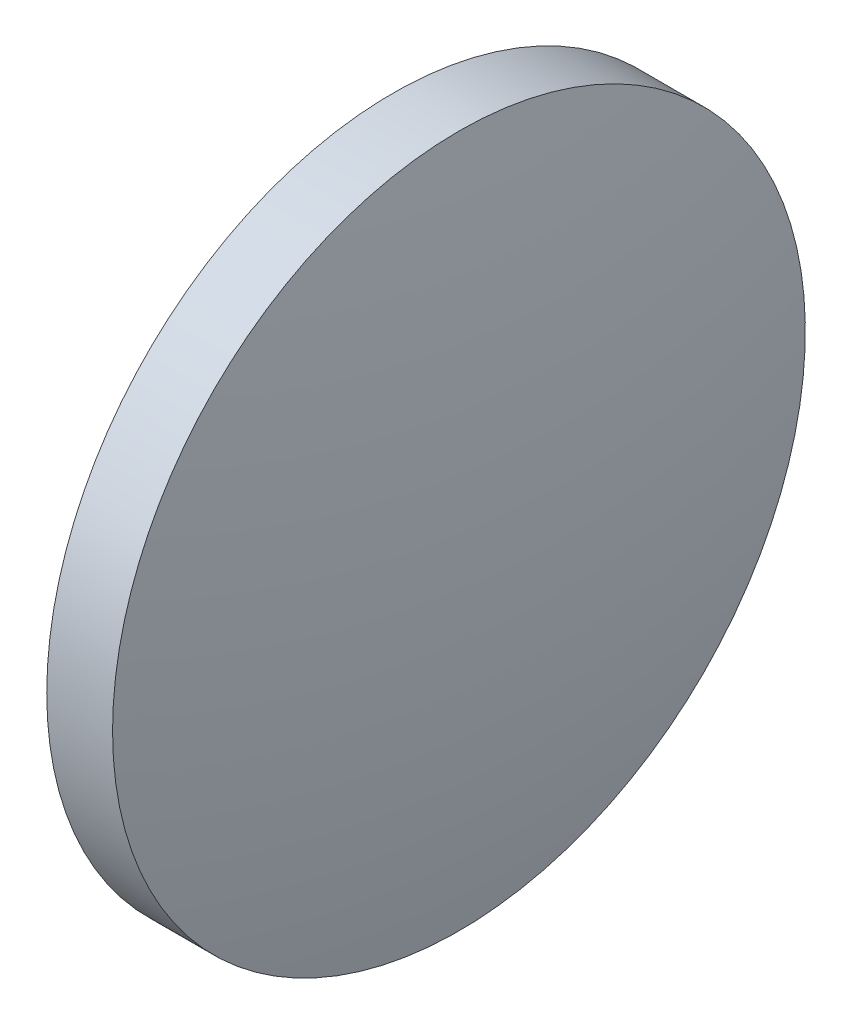
ISO-10303-21;
HEADER;
FILE_DESCRIPTION(('STEP AP214'),'2;1');
FILE_NAME('part.step','',(''),(''),'','','');
FILE_SCHEMA(('AUTOMOTIVE_DESIGN { 1 0 10303 214 1 1 1 1 }'));
ENDSEC;
DATA;
#1=APPLICATION_CONTEXT('core data for automotive mechanical design processes');
#2=APPLICATION_PROTOCOL_DEFINITION('international standard','automotive_design',2000,#1);
#3=PRODUCT_CONTEXT('',#1,'mechanical');
#4=PRODUCT('Part','Part','',(#3));
#5=PRODUCT_RELATED_PRODUCT_CATEGORY('part','',(#4));
#6=PRODUCT_DEFINITION_FORMATION('','',#4);
#7=PRODUCT_DEFINITION_CONTEXT('part definition',#1,'design');
#8=PRODUCT_DEFINITION('design','',#6,#7);
#9=PRODUCT_DEFINITION_SHAPE('','',#8);
#10=(LENGTH_UNIT() NAMED_UNIT(*) SI_UNIT(.MILLI.,.METRE.));
#11=(NAMED_UNIT(*) PLANE_ANGLE_UNIT() SI_UNIT($,.RADIAN.));
#12=(NAMED_UNIT(*) SI_UNIT($,.STERADIAN.) SOLID_ANGLE_UNIT());
#13=UNCERTAINTY_MEASURE_WITH_UNIT(LENGTH_MEASURE(1.E-05),#10,'distance_accuracy_value','');
#14=(GEOMETRIC_REPRESENTATION_CONTEXT(3) GLOBAL_UNCERTAINTY_ASSIGNED_CONTEXT((#13)) GLOBAL_UNIT_ASSIGNED_CONTEXT((#10,
#11,#12)) REPRESENTATION_CONTEXT('',''));
#15=CARTESIAN_POINT('',(0.,0.,0.));
#16=DIRECTION('',(0.,0.,1.));
#17=DIRECTION('',(1.,0.,0.));
#18=AXIS2_PLACEMENT_3D('',#15,#16,#17);
#19=CARTESIAN_POINT('',(369.051851816378,111.079788521564,0.));
#20=DIRECTION('',(-1.,0.,0.));
#21=DIRECTION('',(0.,1.,0.));
#22=AXIS2_PLACEMENT_3D('',#19,#20,#21);
#23=SPHERICAL_SURFACE('',#22,41.4156410256409);
#24=CARTESIAN_POINT('',(409.687492842018,111.079788521564,0.));
#25=DIRECTION('',(-1.,0.,0.));
#26=DIRECTION('',(0.,0.,1.));
#27=AXIS2_PLACEMENT_3D('',#24,#25,#26);
#28=CIRCLE('',#27,7.99999999999999);
#29=CARTESIAN_POINT('',(409.687492842018,111.079788521564,7.99999999999999));
#30=VERTEX_POINT('',#29);
#31=EDGE_CURVE('E10',#30,#30,#28,.T.);
#32=ORIENTED_EDGE('',*,*,#31,.F.);
#33=EDGE_LOOP('',(#32));
#34=FACE_BOUND('',#33,.T.);
#35=ADVANCED_FACE('F35',(#34),#23,.T.);
#36=CARTESIAN_POINT('',(404.442224221656,111.079788521564,0.));
#37=DIRECTION('',(-1.,0.,0.));
#38=DIRECTION('',(0.,0.,1.));
#39=AXIS2_PLACEMENT_3D('',#36,#37,#38);
#40=CYLINDRICAL_SURFACE('',#39,7.99999999999999);
#41=CARTESIAN_POINT('',(408.167492842018,111.079788521564,0.));
#42=DIRECTION('',(-1.,0.,0.));
#43=DIRECTION('',(0.,0.,1.));
#44=AXIS2_PLACEMENT_3D('',#41,#42,#43);
#45=CIRCLE('',#44,7.99999999999999);
#46=CARTESIAN_POINT('',(408.167492842018,111.079788521564,7.99999999999999));
#47=VERTEX_POINT('',#46);
#48=EDGE_CURVE('E41',#47,#47,#45,.T.);
#49=ORIENTED_EDGE('',*,*,#48,.F.);
#50=EDGE_LOOP('',(#49));
#51=FACE_BOUND('',#50,.T.);
#52=ORIENTED_EDGE('',*,*,#31,.T.);
#53=EDGE_LOOP('',(#52));
#54=FACE_BOUND('',#53,.T.);
#55=ADVANCED_FACE('F49',(#51,#54),#40,.T.);
#56=CARTESIAN_POINT('',(408.167492842018,111.079788521564,0.));
#57=DIRECTION('',(1.,0.,0.));
#58=DIRECTION('',(0.,0.,-1.));
#59=AXIS2_PLACEMENT_3D('',#56,#57,#58);
#60=PLANE('',#59);
#61=ORIENTED_EDGE('',*,*,#48,.T.);
#62=EDGE_LOOP('',(#61));
#63=FACE_BOUND('',#62,.T.);
#64=ADVANCED_FACE('F47',(#63),#60,.F.);
#65=CLOSED_SHELL('',(#35,#55,#64));
#66=MANIFOLD_SOLID_BREP('B2',#65);
#67=ADVANCED_BREP_SHAPE_REPRESENTATION('',(#18,#66),#14);
#68=SHAPE_DEFINITION_REPRESENTATION(#9,#67);
ENDSEC;
END-ISO-10303-21;
